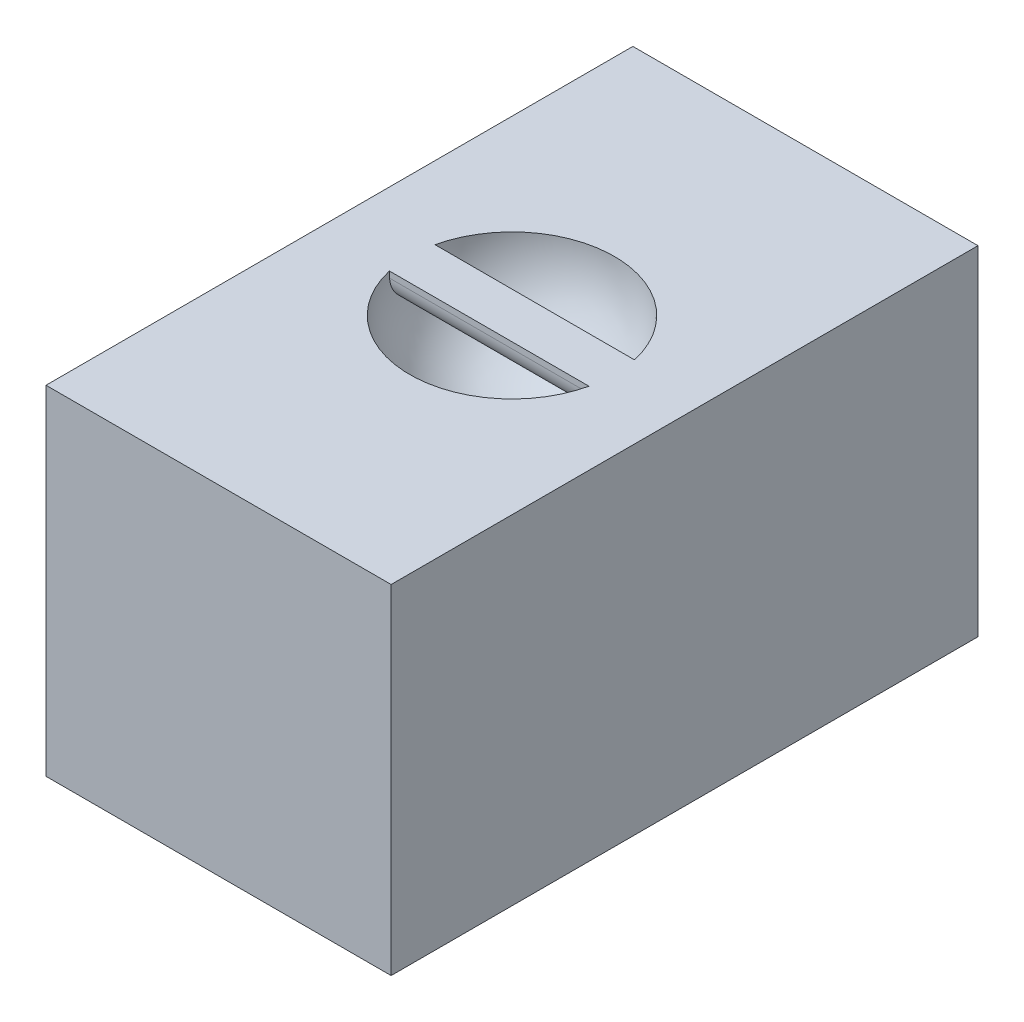
ISO-10303-21;
HEADER;
FILE_DESCRIPTION(('STEP AP214'),'2;1');
FILE_NAME('part.step','',(''),(''),'','','');
FILE_SCHEMA(('AUTOMOTIVE_DESIGN { 1 0 10303 214 1 1 1 1 }'));
ENDSEC;
DATA;
#1=APPLICATION_CONTEXT('core data for automotive mechanical design processes');
#2=APPLICATION_PROTOCOL_DEFINITION('international standard','automotive_design',2000,#1);
#3=PRODUCT_CONTEXT('',#1,'mechanical');
#4=PRODUCT('Part','Part','',(#3));
#5=PRODUCT_RELATED_PRODUCT_CATEGORY('part','',(#4));
#6=PRODUCT_DEFINITION_FORMATION('','',#4);
#7=PRODUCT_DEFINITION_CONTEXT('part definition',#1,'design');
#8=PRODUCT_DEFINITION('design','',#6,#7);
#9=PRODUCT_DEFINITION_SHAPE('','',#8);
#10=(LENGTH_UNIT() NAMED_UNIT(*) SI_UNIT(.MILLI.,.METRE.));
#11=(NAMED_UNIT(*) PLANE_ANGLE_UNIT() SI_UNIT($,.RADIAN.));
#12=(NAMED_UNIT(*) SI_UNIT($,.STERADIAN.) SOLID_ANGLE_UNIT());
#13=UNCERTAINTY_MEASURE_WITH_UNIT(LENGTH_MEASURE(1.E-05),#10,'distance_accuracy_value','');
#14=(GEOMETRIC_REPRESENTATION_CONTEXT(3) GLOBAL_UNCERTAINTY_ASSIGNED_CONTEXT((#13)) GLOBAL_UNIT_ASSIGNED_CONTEXT((#10,
#11,#12)) REPRESENTATION_CONTEXT('',''));
#15=CARTESIAN_POINT('',(0.,0.,0.));
#16=DIRECTION('',(0.,0.,1.));
#17=DIRECTION('',(1.,0.,0.));
#18=AXIS2_PLACEMENT_3D('',#15,#16,#17);
#19=CARTESIAN_POINT('',(28.598962264151,56.134,48.6314150943396));
#20=DIRECTION('',(-1.,0.,0.));
#21=DIRECTION('',(0.,0.,1.));
#22=AXIS2_PLACEMENT_3D('',#19,#20,#21);
#23=PLANE('',#22);
#24=DIRECTION('',(0.,0.,-1.));
#25=VECTOR('',#24,1.);
#26=CARTESIAN_POINT('',(28.598962264151,0.,48.6314150943396));
#27=LINE('',#26,#25);
#28=CARTESIAN_POINT('',(28.598962264151,0.,48.6314150943396));
#29=VERTEX_POINT('',#28);
#30=CARTESIAN_POINT('',(28.598962264151,0.,-48.6314150943396));
#31=VERTEX_POINT('',#30);
#32=EDGE_CURVE('E140',#29,#31,#27,.T.);
#33=ORIENTED_EDGE('',*,*,#32,.T.);
#34=DIRECTION('',(0.,-1.,0.));
#35=VECTOR('',#34,1.);
#36=CARTESIAN_POINT('',(28.598962264151,56.134,-48.6314150943396));
#37=LINE('',#36,#35);
#38=CARTESIAN_POINT('',(28.598962264151,56.134,-48.6314150943396));
#39=VERTEX_POINT('',#38);
#40=EDGE_CURVE('E180',#39,#31,#37,.T.);
#41=ORIENTED_EDGE('',*,*,#40,.F.);
#42=DIRECTION('',(0.,0.,-1.));
#43=VECTOR('',#42,1.);
#44=CARTESIAN_POINT('',(28.598962264151,56.134,48.6314150943396));
#45=LINE('',#44,#43);
#46=CARTESIAN_POINT('',(28.598962264151,56.134,48.6314150943396));
#47=VERTEX_POINT('',#46);
#48=EDGE_CURVE('E143',#47,#39,#45,.T.);
#49=ORIENTED_EDGE('',*,*,#48,.F.);
#50=DIRECTION('',(0.,-1.,0.));
#51=VECTOR('',#50,1.);
#52=CARTESIAN_POINT('',(28.598962264151,56.134,48.6314150943396));
#53=LINE('',#52,#51);
#54=EDGE_CURVE('E157',#47,#29,#53,.T.);
#55=ORIENTED_EDGE('',*,*,#54,.T.);
#56=EDGE_LOOP('',(#33,#41,#49,#55));
#57=FACE_BOUND('',#56,.T.);
#58=ADVANCED_FACE('F39',(#57),#23,.F.);
#59=CARTESIAN_POINT('',(-28.598962264151,56.134,-48.6314150943396));
#60=DIRECTION('',(0.,0.,1.));
#61=DIRECTION('',(1.,0.,0.));
#62=AXIS2_PLACEMENT_3D('',#59,#60,#61);
#63=PLANE('',#62);
#64=DIRECTION('',(-1.,0.,0.));
#65=VECTOR('',#64,1.);
#66=CARTESIAN_POINT('',(-28.598962264151,0.,-48.6314150943396));
#67=LINE('',#66,#65);
#68=CARTESIAN_POINT('',(-28.598962264151,0.,-48.6314150943396));
#69=VERTEX_POINT('',#68);
#70=EDGE_CURVE('E161',#31,#69,#67,.T.);
#71=ORIENTED_EDGE('',*,*,#70,.T.);
#72=DIRECTION('',(0.,-1.,0.));
#73=VECTOR('',#72,1.);
#74=CARTESIAN_POINT('',(-28.598962264151,56.134,-48.6314150943396));
#75=LINE('',#74,#73);
#76=CARTESIAN_POINT('',(-28.598962264151,56.134,-48.6314150943396));
#77=VERTEX_POINT('',#76);
#78=EDGE_CURVE('E176',#77,#69,#75,.T.);
#79=ORIENTED_EDGE('',*,*,#78,.F.);
#80=DIRECTION('',(-1.,0.,0.));
#81=VECTOR('',#80,1.);
#82=CARTESIAN_POINT('',(-28.598962264151,56.134,-48.6314150943396));
#83=LINE('',#82,#81);
#84=EDGE_CURVE('E147',#39,#77,#83,.T.);
#85=ORIENTED_EDGE('',*,*,#84,.F.);
#86=ORIENTED_EDGE('',*,*,#40,.T.);
#87=EDGE_LOOP('',(#71,#79,#85,#86));
#88=FACE_BOUND('',#87,.T.);
#89=ADVANCED_FACE('F215',(#88),#63,.F.);
#90=CARTESIAN_POINT('',(-28.598962264151,56.134,48.6314150943396));
#91=DIRECTION('',(1.,0.,0.));
#92=DIRECTION('',(0.,0.,-1.));
#93=AXIS2_PLACEMENT_3D('',#90,#91,#92);
#94=PLANE('',#93);
#95=DIRECTION('',(0.,0.,1.));
#96=VECTOR('',#95,1.);
#97=CARTESIAN_POINT('',(-28.598962264151,0.,48.6314150943396));
#98=LINE('',#97,#96);
#99=CARTESIAN_POINT('',(-28.598962264151,0.,48.6314150943396));
#100=VERTEX_POINT('',#99);
#101=EDGE_CURVE('E164',#69,#100,#98,.T.);
#102=ORIENTED_EDGE('',*,*,#101,.T.);
#103=DIRECTION('',(0.,-1.,0.));
#104=VECTOR('',#103,1.);
#105=CARTESIAN_POINT('',(-28.598962264151,56.134,48.6314150943396));
#106=LINE('',#105,#104);
#107=CARTESIAN_POINT('',(-28.598962264151,56.134,48.6314150943396));
#108=VERTEX_POINT('',#107);
#109=EDGE_CURVE('E172',#108,#100,#106,.T.);
#110=ORIENTED_EDGE('',*,*,#109,.F.);
#111=DIRECTION('',(0.,0.,1.));
#112=VECTOR('',#111,1.);
#113=CARTESIAN_POINT('',(-28.598962264151,56.134,48.6314150943396));
#114=LINE('',#113,#112);
#115=EDGE_CURVE('E151',#77,#108,#114,.T.);
#116=ORIENTED_EDGE('',*,*,#115,.F.);
#117=ORIENTED_EDGE('',*,*,#78,.T.);
#118=EDGE_LOOP('',(#102,#110,#116,#117));
#119=FACE_BOUND('',#118,.T.);
#120=ADVANCED_FACE('F219',(#119),#94,.F.);
#121=CARTESIAN_POINT('',(-28.598962264151,56.134,48.6314150943396));
#122=DIRECTION('',(0.,0.,-1.));
#123=DIRECTION('',(-1.,0.,0.));
#124=AXIS2_PLACEMENT_3D('',#121,#122,#123);
#125=PLANE('',#124);
#126=DIRECTION('',(1.,0.,0.));
#127=VECTOR('',#126,1.);
#128=CARTESIAN_POINT('',(-28.598962264151,0.,48.6314150943396));
#129=LINE('',#128,#127);
#130=EDGE_CURVE('E148',#100,#29,#129,.T.);
#131=ORIENTED_EDGE('',*,*,#130,.T.);
#132=ORIENTED_EDGE('',*,*,#54,.F.);
#133=DIRECTION('',(1.,0.,0.));
#134=VECTOR('',#133,1.);
#135=CARTESIAN_POINT('',(-28.598962264151,56.134,48.6314150943396));
#136=LINE('',#135,#134);
#137=EDGE_CURVE('E154',#108,#47,#136,.T.);
#138=ORIENTED_EDGE('',*,*,#137,.F.);
#139=ORIENTED_EDGE('',*,*,#109,.T.);
#140=EDGE_LOOP('',(#131,#132,#138,#139));
#141=FACE_BOUND('',#140,.T.);
#142=ADVANCED_FACE('F223',(#141),#125,.F.);
#143=CARTESIAN_POINT('',(0.,56.134,0.));
#144=DIRECTION('',(0.,-1.,0.));
#145=DIRECTION('',(0.,0.,-1.));
#146=AXIS2_PLACEMENT_3D('',#143,#144,#145);
#147=PLANE('',#146);
#148=DIRECTION('',(-1.,0.,0.));
#149=VECTOR('',#148,1.);
#150=CARTESIAN_POINT('',(-18.7200331808285,56.134,-3.77735715106323));
#151=LINE('',#150,#149);
#152=CARTESIAN_POINT('',(16.5379026079722,56.134,-3.77735715106323));
#153=VERTEX_POINT('',#152);
#154=CARTESIAN_POINT('',(-16.5379026079722,56.134,-3.77735715106323));
#155=VERTEX_POINT('',#154);
#156=EDGE_CURVE('E126',#153,#155,#151,.T.);
#157=ORIENTED_EDGE('',*,*,#156,.T.);
#158=CARTESIAN_POINT('',(0.,56.134,0.));
#159=DIRECTION('',(0.,-1.,0.));
#160=DIRECTION('',(0.,0.,-1.));
#161=AXIS2_PLACEMENT_3D('',#158,#159,#160);
#162=CIRCLE('',#161,16.963804105137);
#163=EDGE_CURVE('E114',#155,#153,#162,.T.);
#164=ORIENTED_EDGE('',*,*,#163,.T.);
#165=EDGE_LOOP('',(#157,#164));
#166=FACE_BOUND('',#165,.T.);
#167=DIRECTION('',(1.,0.,0.));
#168=VECTOR('',#167,1.);
#169=CARTESIAN_POINT('',(-18.7200331808285,56.134,3.77735715106322));
#170=LINE('',#169,#168);
#171=CARTESIAN_POINT('',(-16.5379026079722,56.134,3.77735715106322));
#172=VERTEX_POINT('',#171);
#173=CARTESIAN_POINT('',(16.5379026079722,56.134,3.77735715106322));
#174=VERTEX_POINT('',#173);
#175=EDGE_CURVE('E130',#172,#174,#170,.T.);
#176=ORIENTED_EDGE('',*,*,#175,.T.);
#177=EDGE_CURVE('E135',#174,#172,#162,.T.);
#178=ORIENTED_EDGE('',*,*,#177,.T.);
#179=EDGE_LOOP('',(#176,#178));
#180=FACE_BOUND('',#179,.T.);
#181=ORIENTED_EDGE('',*,*,#48,.T.);
#182=ORIENTED_EDGE('',*,*,#84,.T.);
#183=ORIENTED_EDGE('',*,*,#115,.T.);
#184=ORIENTED_EDGE('',*,*,#137,.T.);
#185=EDGE_LOOP('',(#181,#182,#183,#184));
#186=FACE_BOUND('',#185,.T.);
#187=ADVANCED_FACE('F132',(#166,#180,#186),#147,.F.);
#188=CARTESIAN_POINT('',(0.,0.,0.));
#189=DIRECTION('',(0.,-1.,0.));
#190=DIRECTION('',(0.,0.,-1.));
#191=AXIS2_PLACEMENT_3D('',#188,#189,#190);
#192=PLANE('',#191);
#193=ORIENTED_EDGE('',*,*,#32,.F.);
#194=ORIENTED_EDGE('',*,*,#130,.F.);
#195=ORIENTED_EDGE('',*,*,#101,.F.);
#196=ORIENTED_EDGE('',*,*,#70,.F.);
#197=EDGE_LOOP('',(#193,#194,#195,#196));
#198=FACE_BOUND('',#197,.T.);
#199=ADVANCED_FACE('F228',(#198),#192,.T.);
#200=CARTESIAN_POINT('',(0.,56.134,0.));
#201=DIRECTION('',(-1.,0.,0.));
#202=DIRECTION('',(0.,0.,1.));
#203=AXIS2_PLACEMENT_3D('',#200,#201,#202);
#204=SPHERICAL_SURFACE('',#203,16.963804105137);
#205=ORIENTED_EDGE('',*,*,#163,.F.);
#206=CARTESIAN_POINT('',(0.,56.134,-3.77735715106323));
#207=DIRECTION('',(0.,0.,-1.));
#208=DIRECTION('',(-1.,0.,0.));
#209=AXIS2_PLACEMENT_3D('',#206,#207,#208);
#210=CIRCLE('',#209,16.5379026079722);
#211=CARTESIAN_POINT('',(-16.5066643108405,55.118,-3.77735715106323));
#212=VERTEX_POINT('',#211);
#213=EDGE_CURVE('E124',#155,#212,#210,.F.);
#214=ORIENTED_EDGE('',*,*,#213,.T.);
#215=CARTESIAN_POINT('',(-16.5066643108405,55.118,-3.77735715106323));
#216=CARTESIAN_POINT('',(-16.4996143995986,55.003457894055,-3.77736933731575));
#217=CARTESIAN_POINT('',(-16.4924758326361,54.8889232116682,-3.77251518255877));
#218=CARTESIAN_POINT('',(-16.4780728361091,54.6606846603937,-3.75316509365275));
#219=CARTESIAN_POINT('',(-16.4708084128258,54.5469807504442,-3.73866963933784));
#220=CARTESIAN_POINT('',(-16.4562098184747,54.3212912881797,-3.70014202991824));
#221=CARTESIAN_POINT('',(-16.4488757027155,54.2093045319896,-3.67611690634051));
#222=CARTESIAN_POINT('',(-16.4341845013759,53.9877599954516,-3.61870556349574));
#223=CARTESIAN_POINT('',(-16.4268274160585,53.8782021874093,-3.58531945102028));
#224=CARTESIAN_POINT('',(-16.4121402345829,53.6622601236549,-3.50941027679013));
#225=CARTESIAN_POINT('',(-16.404810147002,53.555876811112,-3.46688452975749));
#226=CARTESIAN_POINT('',(-16.3902289220302,53.3470369619196,-3.3729883574109));
#227=CARTESIAN_POINT('',(-16.3829778148227,53.2445818912445,-3.32161466868109));
#228=CARTESIAN_POINT('',(-16.3686126816142,53.0444174236896,-3.21041944353581));
#229=CARTESIAN_POINT('',(-16.3614985829,52.9467054651957,-3.15060253683224));
#230=CARTESIAN_POINT('',(-16.3474542277087,52.7566544409261,-3.02293011145407));
#231=CARTESIAN_POINT('',(-16.3405240398687,52.6643173661757,-2.95507164183656));
#232=CARTESIAN_POINT('',(-16.320093191148,52.3964862072421,-2.74018940422034));
#233=CARTESIAN_POINT('',(-16.3069343228348,52.2299225830755,-2.58171986081013));
#234=CARTESIAN_POINT('',(-16.2819459086305,51.925853792269,-2.23899710198339));
#235=CARTESIAN_POINT('',(-16.2701166238009,51.7883543276781,-2.05473883888471));
#236=CARTESIAN_POINT('',(-16.2481427952265,51.5464189874802,-1.6658611560883));
#237=CARTESIAN_POINT('',(-16.2379962883902,51.4419444549042,-1.46126591329114));
#238=CARTESIAN_POINT('',(-16.2196781082557,51.2689291881495,-1.03739522813283));
#239=CARTESIAN_POINT('',(-16.2115051952354,51.2003658643653,-0.818129112488177));
#240=CARTESIAN_POINT('',(-16.1998677516345,51.118587076232,-0.450106021663133));
#241=CARTESIAN_POINT('',(-16.1957587858278,51.0943826905083,-0.303718509448313));
#242=CARTESIAN_POINT('',(-16.1885217514461,51.0620915858174,-0.00936369045699404));
#243=CARTESIAN_POINT('',(-16.1853922981897,51.0539820270336,0.138601077644517));
#244=CARTESIAN_POINT('',(-16.1827712581812,51.054,0.286642848936772));
#245=B_SPLINE_CURVE_WITH_KNOTS('',3,(#215,#216,#217,#218,#219,#220,#221,#222,#223,#224,#225,
#226,#227,#228,#229,#230,#231,#232,#233,#234,#235,#236,#237,#238,#239,#240,#241,#242,#243,#244),
.UNSPECIFIED.,.F.,.F.,(4,2,2,2,2,2,2,2,2,2,2,2,2,2,4),(0.,0.344171144709972,0.688325161780267,
1.0322257135929,1.37612234229551,1.72012014829691,2.06424510494188,2.40818209361754,
2.75224568699945,3.43952500685657,4.12693903800802,4.81354541883001,5.49971937612537,
5.94419056440525,6.38803056107115),.UNSPECIFIED.);
#246=CARTESIAN_POINT('',(-16.1884829580043,51.0641213785861,0.));
#247=VERTEX_POINT('',#246);
#248=EDGE_CURVE('E62',#212,#247,#245,.T.);
#249=ORIENTED_EDGE('',*,*,#248,.T.);
#250=CARTESIAN_POINT('',(-16.1827712581812,51.054,-0.286642848936777));
#251=CARTESIAN_POINT('',(-16.1847941193365,51.0539876064313,-0.172394303673831));
#252=CARTESIAN_POINT('',(-16.1871205141302,51.0588171674146,-0.0581532440719257));
#253=CARTESIAN_POINT('',(-16.1923592315017,51.0780677597872,0.169498133225995));
#254=CARTESIAN_POINT('',(-16.1952715207908,51.0924882463565,0.28290849774034));
#255=CARTESIAN_POINT('',(-16.201658452612,51.1308122519748,0.508001792143143));
#256=CARTESIAN_POINT('',(-16.2051326232005,51.1547078368012,0.619686086311097));
#257=CARTESIAN_POINT('',(-16.2126187474286,51.2118038498785,0.840630361406417));
#258=CARTESIAN_POINT('',(-16.2166306956589,51.2450041845389,0.949890366706229));
#259=CARTESIAN_POINT('',(-16.2251637013761,51.3204809171504,1.16524079215156));
#260=CARTESIAN_POINT('',(-16.2296848894688,51.3627596459875,1.27133039030828));
#261=CARTESIAN_POINT('',(-16.2392035392312,51.4560982891156,1.47959623844612));
#262=CARTESIAN_POINT('',(-16.2442011762799,51.5071614425268,1.58177102784915));
#263=CARTESIAN_POINT('',(-16.2546322596257,51.6176707185049,1.78139802147785));
#264=CARTESIAN_POINT('',(-16.2600654775175,51.677112459836,1.87885265835298));
#265=CARTESIAN_POINT('',(-16.2713297759326,51.8039668048543,2.06841801177604));
#266=CARTESIAN_POINT('',(-16.277161002474,51.8713823406196,2.16052674388324));
#267=CARTESIAN_POINT('',(-16.2952018542272,52.0850545205047,2.42800891700039));
#268=CARTESIAN_POINT('',(-16.3079551771259,52.2426999195127,2.59447196332805));
#269=CARTESIAN_POINT('',(-16.3345149468169,52.5835883153049,2.89849345859761));
#270=CARTESIAN_POINT('',(-16.3483216063327,52.7668364888652,3.0360460478423));
#271=CARTESIAN_POINT('',(-16.3766248851676,53.1541872483496,3.27872778030214));
#272=CARTESIAN_POINT('',(-16.3911229134329,53.3583334854954,3.38378713440323));
#273=CARTESIAN_POINT('',(-16.4203625989698,53.7813152030637,3.55804477264968));
#274=CARTESIAN_POINT('',(-16.4351041101255,54.0001420988422,3.62726381179452));
#275=CARTESIAN_POINT('',(-16.4593974061783,54.3699129590948,3.71075128067815));
#276=CARTESIAN_POINT('',(-16.4690027684108,54.5185267858401,3.7357121169613));
#277=CARTESIAN_POINT('',(-16.4880096267279,54.817403222928,3.76901295346534));
#278=CARTESIAN_POINT('',(-16.4974113924565,54.9676631979336,3.77737646017409));
#279=CARTESIAN_POINT('',(-16.5066643108405,55.118,3.77735715106322));
#280=B_SPLINE_CURVE_WITH_KNOTS('',3,(#250,#251,#252,#253,#254,#255,#256,#257,#258,#259,#260,
#261,#262,#263,#264,#265,#266,#267,#268,#269,#270,#271,#272,#273,#274,#275,#276,#277,#278,#279),
.UNSPECIFIED.,.F.,.F.,(4,2,2,2,2,2,2,2,2,2,2,2,2,2,4),(0.,0.342693928647229,0.685368391961322,
1.02775651173843,1.37014118777581,1.71261387672525,2.05521311890019,2.39763387302889,
2.74018093391944,3.42550012863709,4.11095809316354,4.79787822429488,5.48440011625412,
5.93654150423016,6.38804207449238),.UNSPECIFIED.);
#281=CARTESIAN_POINT('',(-16.5066643108405,55.118,3.77735715106322));
#282=VERTEX_POINT('',#281);
#283=EDGE_CURVE('E11',#247,#282,#280,.T.);
#284=ORIENTED_EDGE('',*,*,#283,.T.);
#285=CARTESIAN_POINT('',(0.,56.134,3.77735715106322));
#286=DIRECTION('',(0.,0.,1.));
#287=DIRECTION('',(1.,0.,0.));
#288=AXIS2_PLACEMENT_3D('',#285,#286,#287);
#289=CIRCLE('',#288,16.5379026079722);
#290=EDGE_CURVE('E121',#282,#172,#289,.F.);
#291=ORIENTED_EDGE('',*,*,#290,.T.);
#292=ORIENTED_EDGE('',*,*,#177,.F.);
#293=CARTESIAN_POINT('',(16.5066643108405,55.118,3.77735715106322));
#294=VERTEX_POINT('',#293);
#295=EDGE_CURVE('E122',#174,#294,#289,.F.);
#296=ORIENTED_EDGE('',*,*,#295,.T.);
#297=CARTESIAN_POINT('',(16.5066643108405,55.118,3.77735715106322));
#298=CARTESIAN_POINT('',(16.4996143995986,55.003457894055,3.77736933731575));
#299=CARTESIAN_POINT('',(16.4924758326361,54.8889232116682,3.77251518255877));
#300=CARTESIAN_POINT('',(16.4780728361091,54.6606846603937,3.75316509365275));
#301=CARTESIAN_POINT('',(16.4708084128258,54.5469807504442,3.73866963933783));
#302=CARTESIAN_POINT('',(16.4562098184747,54.3212912881797,3.70014202991823));
#303=CARTESIAN_POINT('',(16.4488757027155,54.2093045319896,3.6761169063405));
#304=CARTESIAN_POINT('',(16.4341845013759,53.9877599954516,3.61870556349573));
#305=CARTESIAN_POINT('',(16.4268274160585,53.8782021874093,3.58531945102028));
#306=CARTESIAN_POINT('',(16.4121402345829,53.6622601236549,3.50941027679012));
#307=CARTESIAN_POINT('',(16.404810147002,53.555876811112,3.46688452975748));
#308=CARTESIAN_POINT('',(16.3902289220302,53.3470369619196,3.3729883574109));
#309=CARTESIAN_POINT('',(16.3829778148227,53.2445818912445,3.32161466868108));
#310=CARTESIAN_POINT('',(16.3686126816142,53.0444174236896,3.2104194435358));
#311=CARTESIAN_POINT('',(16.3614985829,52.9467054651957,3.15060253683224));
#312=CARTESIAN_POINT('',(16.3474542277087,52.7566544409261,3.02293011145407));
#313=CARTESIAN_POINT('',(16.3405240398687,52.6643173661757,2.95507164183656));
#314=CARTESIAN_POINT('',(16.320093191148,52.3964862072421,2.74018940422034));
#315=CARTESIAN_POINT('',(16.3069343228348,52.2299225830755,2.58171986081013));
#316=CARTESIAN_POINT('',(16.2819459086305,51.925853792269,2.23899710198339));
#317=CARTESIAN_POINT('',(16.2701166238009,51.7883543276781,2.05473883888471));
#318=CARTESIAN_POINT('',(16.2481427952265,51.5464189874802,1.66586115608829));
#319=CARTESIAN_POINT('',(16.2379962883902,51.4419444549042,1.46126591329113));
#320=CARTESIAN_POINT('',(16.2196781082557,51.2689291881495,1.03739522813282));
#321=CARTESIAN_POINT('',(16.2115051952354,51.2003658643653,0.818129112488171));
#322=CARTESIAN_POINT('',(16.1998677516345,51.118587076232,0.450106021663126));
#323=CARTESIAN_POINT('',(16.1957587858278,51.0943826905083,0.303718509448307));
#324=CARTESIAN_POINT('',(16.1885217514461,51.0620915858174,0.00936369045698732));
#325=CARTESIAN_POINT('',(16.1853922981897,51.0539820270336,-0.138601077644523));
#326=CARTESIAN_POINT('',(16.1827712581812,51.054,-0.286642848936778));
#327=B_SPLINE_CURVE_WITH_KNOTS('',3,(#297,#298,#299,#300,#301,#302,#303,#304,#305,#306,#307,
#308,#309,#310,#311,#312,#313,#314,#315,#316,#317,#318,#319,#320,#321,#322,#323,#324,#325,#326),
.UNSPECIFIED.,.F.,.F.,(4,2,2,2,2,2,2,2,2,2,2,2,2,2,4),(0.,0.344171144709972,0.688325161780274,
1.0322257135929,1.37612234229551,1.72012014829691,2.06424510494188,2.40818209361753,
2.75224568699945,3.43952500685656,4.12693903800802,4.81354541883001,5.49971937612537,
5.94419056440525,6.38803056107115),.UNSPECIFIED.);
#328=CARTESIAN_POINT('',(16.1884829580043,51.0641213785861,0.));
#329=VERTEX_POINT('',#328);
#330=EDGE_CURVE('E50',#294,#329,#327,.T.);
#331=ORIENTED_EDGE('',*,*,#330,.T.);
#332=CARTESIAN_POINT('',(16.1827712581812,51.054,0.286642848936772));
#333=CARTESIAN_POINT('',(16.1847941193365,51.0539876064313,0.172394303673826));
#334=CARTESIAN_POINT('',(16.1871205141302,51.0588171674146,0.0581532440719204));
#335=CARTESIAN_POINT('',(16.1923592315017,51.0780677597872,-0.169498133226));
#336=CARTESIAN_POINT('',(16.1952715207908,51.0924882463565,-0.282908497740346));
#337=CARTESIAN_POINT('',(16.201658452612,51.1308122519748,-0.508001792143148));
#338=CARTESIAN_POINT('',(16.2051326232005,51.1547078368012,-0.619686086311102));
#339=CARTESIAN_POINT('',(16.2126187474286,51.2118038498785,-0.840630361406423));
#340=CARTESIAN_POINT('',(16.2166306956589,51.2450041845389,-0.949890366706234));
#341=CARTESIAN_POINT('',(16.2251637013761,51.3204809171504,-1.16524079215156));
#342=CARTESIAN_POINT('',(16.2296848894688,51.3627596459875,-1.27133039030828));
#343=CARTESIAN_POINT('',(16.2392035392312,51.4560982891156,-1.47959623844613));
#344=CARTESIAN_POINT('',(16.2442011762799,51.5071614425268,-1.58177102784916));
#345=CARTESIAN_POINT('',(16.2546322596257,51.6176707185049,-1.78139802147785));
#346=CARTESIAN_POINT('',(16.2600654775175,51.677112459836,-1.87885265835299));
#347=CARTESIAN_POINT('',(16.2713297759326,51.8039668048543,-2.06841801177604));
#348=CARTESIAN_POINT('',(16.277161002474,51.8713823406196,-2.16052674388324));
#349=CARTESIAN_POINT('',(16.2952018542272,52.0850545205047,-2.4280089170004));
#350=CARTESIAN_POINT('',(16.3079551771259,52.2426999195127,-2.59447196332806));
#351=CARTESIAN_POINT('',(16.3345149468169,52.5835883153049,-2.89849345859761));
#352=CARTESIAN_POINT('',(16.3483216063327,52.7668364888652,-3.0360460478423));
#353=CARTESIAN_POINT('',(16.3766248851676,53.1541872483496,-3.27872778030215));
#354=CARTESIAN_POINT('',(16.3911229134329,53.3583334854954,-3.38378713440323));
#355=CARTESIAN_POINT('',(16.4203625989698,53.7813152030637,-3.55804477264968));
#356=CARTESIAN_POINT('',(16.4351041101255,54.0001420988422,-3.62726381179453));
#357=CARTESIAN_POINT('',(16.4593974061783,54.3699129590948,-3.71075128067816));
#358=CARTESIAN_POINT('',(16.4690027684108,54.5185267858401,-3.7357121169613));
#359=CARTESIAN_POINT('',(16.4880096267279,54.817403222928,-3.76901295346535));
#360=CARTESIAN_POINT('',(16.4974113924565,54.9676631979336,-3.7773764601741));
#361=CARTESIAN_POINT('',(16.5066643108405,55.118,-3.77735715106323));
#362=B_SPLINE_CURVE_WITH_KNOTS('',3,(#332,#333,#334,#335,#336,#337,#338,#339,#340,#341,#342,
#343,#344,#345,#346,#347,#348,#349,#350,#351,#352,#353,#354,#355,#356,#357,#358,#359,#360,#361),
.UNSPECIFIED.,.F.,.F.,(4,2,2,2,2,2,2,2,2,2,2,2,2,2,4),(0.,0.342693928647229,0.685368391961322,
1.02775651173843,1.37014118777581,1.71261387672525,2.05521311890019,2.39763387302889,
2.74018093391944,3.42550012863709,4.11095809316354,4.79787822429488,5.48440011625412,
5.93654150423016,6.38804207449238),.UNSPECIFIED.);
#363=CARTESIAN_POINT('',(16.5066643108405,55.118,-3.77735715106323));
#364=VERTEX_POINT('',#363);
#365=EDGE_CURVE('E116',#329,#364,#362,.T.);
#366=ORIENTED_EDGE('',*,*,#365,.T.);
#367=EDGE_CURVE('E110',#364,#153,#210,.F.);
#368=ORIENTED_EDGE('',*,*,#367,.T.);
#369=EDGE_LOOP('',(#205,#214,#249,#284,#291,#292,#296,#331,#366,#368));
#370=FACE_BOUND('',#369,.T.);
#371=ADVANCED_FACE('F112',(#370),#204,.F.);
#372=CARTESIAN_POINT('',(-18.7200331808285,51.054,-3.77735715106323));
#373=DIRECTION('',(0.,0.,-1.));
#374=DIRECTION('',(-1.,0.,0.));
#375=AXIS2_PLACEMENT_3D('',#372,#373,#374);
#376=PLANE('',#375);
#377=ORIENTED_EDGE('',*,*,#367,.F.);
#378=DIRECTION('',(-1.,0.,0.));
#379=VECTOR('',#378,1.);
#380=CARTESIAN_POINT('',(-18.7200331808285,55.118,-3.77735715106323));
#381=LINE('',#380,#379);
#382=EDGE_CURVE('E186',#364,#212,#381,.T.);
#383=ORIENTED_EDGE('',*,*,#382,.T.);
#384=ORIENTED_EDGE('',*,*,#213,.F.);
#385=ORIENTED_EDGE('',*,*,#156,.F.);
#386=EDGE_LOOP('',(#377,#383,#384,#385));
#387=FACE_BOUND('',#386,.T.);
#388=ADVANCED_FACE('F127',(#387),#376,.T.);
#389=CARTESIAN_POINT('',(-18.7200331808285,51.054,3.77735715106322));
#390=DIRECTION('',(0.,0.,1.));
#391=DIRECTION('',(1.,0.,0.));
#392=AXIS2_PLACEMENT_3D('',#389,#390,#391);
#393=PLANE('',#392);
#394=ORIENTED_EDGE('',*,*,#290,.F.);
#395=DIRECTION('',(1.,0.,0.));
#396=VECTOR('',#395,1.);
#397=CARTESIAN_POINT('',(-18.7200331808285,55.118,3.77735715106322));
#398=LINE('',#397,#396);
#399=EDGE_CURVE('E189',#282,#294,#398,.T.);
#400=ORIENTED_EDGE('',*,*,#399,.T.);
#401=ORIENTED_EDGE('',*,*,#295,.F.);
#402=ORIENTED_EDGE('',*,*,#175,.F.);
#403=EDGE_LOOP('',(#394,#400,#401,#402));
#404=FACE_BOUND('',#403,.T.);
#405=ADVANCED_FACE('F251',(#404),#393,.T.);
#406=CARTESIAN_POINT('',(-18.7200331808285,55.118,-0.286642848936777));
#407=DIRECTION('',(1.,0.,0.));
#408=DIRECTION('',(0.,0.,-1.));
#409=AXIS2_PLACEMENT_3D('',#406,#407,#408);
#410=CYLINDRICAL_SURFACE('',#409,4.064);
#411=DIRECTION('',(1.,0.,0.));
#412=VECTOR('',#411,1.);
#413=CARTESIAN_POINT('',(0.,51.0641213785865,0.));
#414=LINE('',#413,#412);
#415=EDGE_CURVE('E44',#329,#247,#414,.F.);
#416=ORIENTED_EDGE('',*,*,#415,.F.);
#417=ORIENTED_EDGE('',*,*,#330,.F.);
#418=ORIENTED_EDGE('',*,*,#399,.F.);
#419=ORIENTED_EDGE('',*,*,#283,.F.);
#420=EDGE_LOOP('',(#416,#417,#418,#419));
#421=FACE_BOUND('',#420,.T.);
#422=ADVANCED_FACE('F41',(#421),#410,.T.);
#423=CARTESIAN_POINT('',(-18.7200331808285,55.118,0.286642848936773));
#424=DIRECTION('',(-1.,0.,0.));
#425=DIRECTION('',(0.,0.,1.));
#426=AXIS2_PLACEMENT_3D('',#423,#424,#425);
#427=CYLINDRICAL_SURFACE('',#426,4.064);
#428=ORIENTED_EDGE('',*,*,#365,.F.);
#429=ORIENTED_EDGE('',*,*,#415,.T.);
#430=ORIENTED_EDGE('',*,*,#248,.F.);
#431=ORIENTED_EDGE('',*,*,#382,.F.);
#432=EDGE_LOOP('',(#428,#429,#430,#431));
#433=FACE_BOUND('',#432,.T.);
#434=ADVANCED_FACE('F207',(#433),#427,.T.);
#435=CLOSED_SHELL('',(#58,#89,#120,#142,#187,#199,#371,#388,#405,#422,#434));
#436=MANIFOLD_SOLID_BREP('B2',#435);
#437=ADVANCED_BREP_SHAPE_REPRESENTATION('',(#18,#436),#14);
#438=SHAPE_DEFINITION_REPRESENTATION(#9,#437);
ENDSEC;
END-ISO-10303-21;
